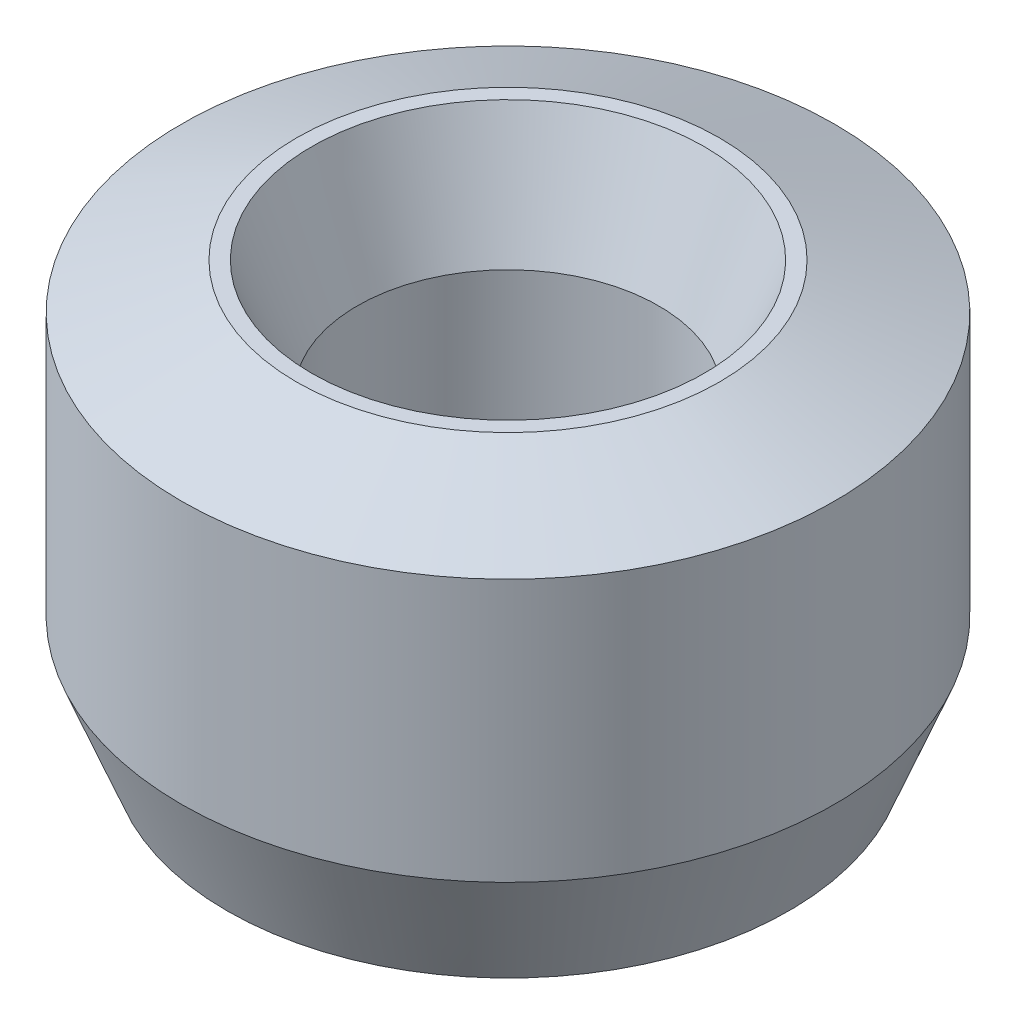
ISO-10303-21;
HEADER;
FILE_DESCRIPTION(('STEP AP214'),'2;1');
FILE_NAME('part.step','',(''),(''),'','','');
FILE_SCHEMA(('AUTOMOTIVE_DESIGN { 1 0 10303 214 1 1 1 1 }'));
ENDSEC;
DATA;
#1=APPLICATION_CONTEXT('core data for automotive mechanical design processes');
#2=APPLICATION_PROTOCOL_DEFINITION('international standard','automotive_design',2000,#1);
#3=PRODUCT_CONTEXT('',#1,'mechanical');
#4=PRODUCT('Part','Part','',(#3));
#5=PRODUCT_RELATED_PRODUCT_CATEGORY('part','',(#4));
#6=PRODUCT_DEFINITION_FORMATION('','',#4);
#7=PRODUCT_DEFINITION_CONTEXT('part definition',#1,'design');
#8=PRODUCT_DEFINITION('design','',#6,#7);
#9=PRODUCT_DEFINITION_SHAPE('','',#8);
#10=(LENGTH_UNIT() NAMED_UNIT(*) SI_UNIT(.MILLI.,.METRE.));
#11=(NAMED_UNIT(*) PLANE_ANGLE_UNIT() SI_UNIT($,.RADIAN.));
#12=(NAMED_UNIT(*) SI_UNIT($,.STERADIAN.) SOLID_ANGLE_UNIT());
#13=UNCERTAINTY_MEASURE_WITH_UNIT(LENGTH_MEASURE(1.E-05),#10,'distance_accuracy_value','');
#14=(GEOMETRIC_REPRESENTATION_CONTEXT(3) GLOBAL_UNCERTAINTY_ASSIGNED_CONTEXT((#13)) GLOBAL_UNIT_ASSIGNED_CONTEXT((#10,
#11,#12)) REPRESENTATION_CONTEXT('',''));
#15=CARTESIAN_POINT('',(0.,0.,0.));
#16=DIRECTION('',(0.,0.,1.));
#17=DIRECTION('',(1.,0.,0.));
#18=AXIS2_PLACEMENT_3D('',#15,#16,#17);
#19=CARTESIAN_POINT('',(0.,35.6411810645792,0.));
#20=DIRECTION('',(0.,-1.,0.));
#21=DIRECTION('',(0.,0.,-1.));
#22=AXIS2_PLACEMENT_3D('',#19,#20,#21);
#23=CYLINDRICAL_SURFACE('',#22,27.5);
#24=CARTESIAN_POINT('',(0.,9.690757932698,0.));
#25=DIRECTION('',(0.,1.,0.));
#26=DIRECTION('',(0.,0.,1.));
#27=AXIS2_PLACEMENT_3D('',#24,#25,#26);
#28=CIRCLE('',#27,27.5);
#29=CARTESIAN_POINT('',(0.,9.690757932698,27.5));
#30=VERTEX_POINT('',#29);
#31=EDGE_CURVE('E10',#30,#30,#28,.T.);
#32=ORIENTED_EDGE('',*,*,#31,.T.);
#33=EDGE_LOOP('',(#32));
#34=FACE_BOUND('',#33,.T.);
#35=CARTESIAN_POINT('',(0.,31.8007616087033,0.));
#36=DIRECTION('',(0.,1.,0.));
#37=DIRECTION('',(0.,0.,1.));
#38=AXIS2_PLACEMENT_3D('',#35,#36,#37);
#39=CIRCLE('',#38,27.5);
#40=CARTESIAN_POINT('',(0.,31.8007616087033,27.5));
#41=VERTEX_POINT('',#40);
#42=EDGE_CURVE('E50',#41,#41,#39,.F.);
#43=ORIENTED_EDGE('',*,*,#42,.T.);
#44=EDGE_LOOP('',(#43));
#45=FACE_BOUND('',#44,.T.);
#46=ADVANCED_FACE('F39',(#34,#45),#23,.T.);
#47=CARTESIAN_POINT('',(0.,35.6411810645792,0.));
#48=DIRECTION('',(0.,1.,0.));
#49=DIRECTION('',(0.,0.,1.));
#50=AXIS2_PLACEMENT_3D('',#47,#48,#49);
#51=PLANE('',#50);
#52=CARTESIAN_POINT('',(0.,35.6411810645792,0.));
#53=DIRECTION('',(0.,1.,0.));
#54=DIRECTION('',(0.,0.,1.));
#55=AXIS2_PLACEMENT_3D('',#52,#53,#54);
#56=CIRCLE('',#55,16.5337153885561);
#57=CARTESIAN_POINT('',(0.,35.6411810645792,16.5337153885561));
#58=VERTEX_POINT('',#57);
#59=EDGE_CURVE('E58',#58,#58,#56,.F.);
#60=ORIENTED_EDGE('',*,*,#59,.T.);
#61=EDGE_LOOP('',(#60));
#62=FACE_BOUND('',#61,.T.);
#63=CARTESIAN_POINT('',(0.,35.6411810645792,0.));
#64=DIRECTION('',(0.,1.,0.));
#65=DIRECTION('',(0.,0.,1.));
#66=AXIS2_PLACEMENT_3D('',#63,#64,#65);
#67=CIRCLE('',#66,17.809242067302);
#68=CARTESIAN_POINT('',(0.,35.6411810645792,17.809242067302));
#69=VERTEX_POINT('',#68);
#70=EDGE_CURVE('E61',#69,#69,#67,.T.);
#71=ORIENTED_EDGE('',*,*,#70,.T.);
#72=EDGE_LOOP('',(#71));
#73=FACE_BOUND('',#72,.T.);
#74=ADVANCED_FACE('F88',(#62,#73),#51,.T.);
#75=CARTESIAN_POINT('',(0.,0.,0.));
#76=DIRECTION('',(0.,1.,0.));
#77=DIRECTION('',(0.,0.,1.));
#78=AXIS2_PLACEMENT_3D('',#75,#76,#77);
#79=PLANE('',#78);
#80=CARTESIAN_POINT('',(0.,0.,0.));
#81=DIRECTION('',(0.,1.,0.));
#82=DIRECTION('',(0.,0.,1.));
#83=AXIS2_PLACEMENT_3D('',#80,#81,#82);
#84=CIRCLE('',#83,22.3840538653783);
#85=CARTESIAN_POINT('',(0.,0.,22.3840538653783));
#86=VERTEX_POINT('',#85);
#87=EDGE_CURVE('E51',#86,#86,#84,.T.);
#88=ORIENTED_EDGE('',*,*,#87,.T.);
#89=EDGE_LOOP('',(#88));
#90=FACE_BOUND('',#89,.T.);
#91=CARTESIAN_POINT('',(0.,0.,0.));
#92=DIRECTION('',(0.,1.,0.));
#93=DIRECTION('',(0.,0.,1.));
#94=AXIS2_PLACEMENT_3D('',#91,#92,#93);
#95=CIRCLE('',#94,23.6595805441241);
#96=CARTESIAN_POINT('',(0.,0.,23.6595805441241));
#97=VERTEX_POINT('',#96);
#98=EDGE_CURVE('E54',#97,#97,#95,.F.);
#99=ORIENTED_EDGE('',*,*,#98,.T.);
#100=EDGE_LOOP('',(#99));
#101=FACE_BOUND('',#100,.T.);
#102=ADVANCED_FACE('F83',(#90,#101),#79,.F.);
#103=CARTESIAN_POINT('',(0.,35.6411810645792,0.));
#104=DIRECTION('',(0.,-1.,0.));
#105=DIRECTION('',(0.,0.,-1.));
#106=AXIS2_PLACEMENT_3D('',#103,#104,#105);
#107=CYLINDRICAL_SURFACE('',#106,12.6932959326803);
#108=CARTESIAN_POINT('',(0.,25.9504231318812,0.));
#109=DIRECTION('',(0.,1.,0.));
#110=DIRECTION('',(0.,0.,1.));
#111=AXIS2_PLACEMENT_3D('',#108,#109,#110);
#112=CIRCLE('',#111,12.6932959326803);
#113=CARTESIAN_POINT('',(0.,25.9504231318812,12.6932959326803));
#114=VERTEX_POINT('',#113);
#115=EDGE_CURVE('E67',#114,#114,#112,.T.);
#116=ORIENTED_EDGE('',*,*,#115,.T.);
#117=EDGE_LOOP('',(#116));
#118=FACE_BOUND('',#117,.T.);
#119=CARTESIAN_POINT('',(0.,3.84041945587586,0.));
#120=DIRECTION('',(0.,1.,0.));
#121=DIRECTION('',(0.,0.,1.));
#122=AXIS2_PLACEMENT_3D('',#119,#120,#121);
#123=CIRCLE('',#122,12.6932959326803);
#124=CARTESIAN_POINT('',(0.,3.84041945587586,12.6932959326803));
#125=VERTEX_POINT('',#124);
#126=EDGE_CURVE('E69',#125,#125,#123,.F.);
#127=ORIENTED_EDGE('',*,*,#126,.T.);
#128=EDGE_LOOP('',(#127));
#129=FACE_BOUND('',#128,.T.);
#130=ADVANCED_FACE('F71',(#118,#129),#107,.F.);
#131=CARTESIAN_POINT('',(0.,25.9504231318812,0.));
#132=DIRECTION('',(0.,1.,0.));
#133=DIRECTION('',(0.,0.,1.));
#134=AXIS2_PLACEMENT_3D('',#131,#132,#133);
#135=CONICAL_SURFACE('',#134,12.6932959326803,0.37731016864702);
#136=ORIENTED_EDGE('',*,*,#59,.F.);
#137=EDGE_LOOP('',(#136));
#138=FACE_BOUND('',#137,.T.);
#139=ORIENTED_EDGE('',*,*,#115,.F.);
#140=EDGE_LOOP('',(#139));
#141=FACE_BOUND('',#140,.T.);
#142=ADVANCED_FACE('F77',(#138,#141),#135,.F.);
#143=CARTESIAN_POINT('',(0.,0.,0.));
#144=DIRECTION('',(0.,-1.,0.));
#145=DIRECTION('',(0.,0.,-1.));
#146=AXIS2_PLACEMENT_3D('',#143,#144,#145);
#147=CONICAL_SURFACE('',#146,22.3840538653783,1.19348615814788);
#148=ORIENTED_EDGE('',*,*,#126,.F.);
#149=EDGE_LOOP('',(#148));
#150=FACE_BOUND('',#149,.T.);
#151=ORIENTED_EDGE('',*,*,#87,.F.);
#152=EDGE_LOOP('',(#151));
#153=FACE_BOUND('',#152,.T.);
#154=ADVANCED_FACE('F73',(#150,#153),#147,.F.);
#155=CARTESIAN_POINT('',(0.,9.690757932698,0.));
#156=DIRECTION('',(0.,1.,0.));
#157=DIRECTION('',(0.,0.,1.));
#158=AXIS2_PLACEMENT_3D('',#155,#156,#157);
#159=CONICAL_SURFACE('',#158,27.5,0.37731016864702);
#160=ORIENTED_EDGE('',*,*,#98,.F.);
#161=EDGE_LOOP('',(#160));
#162=FACE_BOUND('',#161,.T.);
#163=ORIENTED_EDGE('',*,*,#31,.F.);
#164=EDGE_LOOP('',(#163));
#165=FACE_BOUND('',#164,.T.);
#166=ADVANCED_FACE('F76',(#162,#165),#159,.T.);
#167=CARTESIAN_POINT('',(0.,35.6411810645792,0.));
#168=DIRECTION('',(0.,-1.,0.));
#169=DIRECTION('',(0.,0.,-1.));
#170=AXIS2_PLACEMENT_3D('',#167,#168,#169);
#171=CONICAL_SURFACE('',#170,17.809242067302,1.19348615814788);
#172=ORIENTED_EDGE('',*,*,#42,.F.);
#173=EDGE_LOOP('',(#172));
#174=FACE_BOUND('',#173,.T.);
#175=ORIENTED_EDGE('',*,*,#70,.F.);
#176=EDGE_LOOP('',(#175));
#177=FACE_BOUND('',#176,.T.);
#178=ADVANCED_FACE('F45',(#174,#177),#171,.T.);
#179=CLOSED_SHELL('',(#46,#74,#102,#130,#142,#154,#166,#178));
#180=MANIFOLD_SOLID_BREP('B2',#179);
#181=ADVANCED_BREP_SHAPE_REPRESENTATION('',(#18,#180),#14);
#182=SHAPE_DEFINITION_REPRESENTATION(#9,#181);
ENDSEC;
END-ISO-10303-21;
